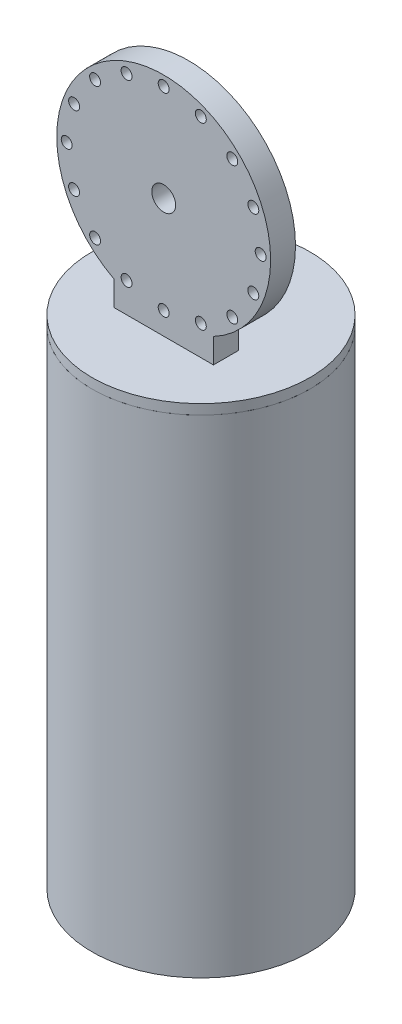
ISO-10303-21;
HEADER;
FILE_DESCRIPTION(('STEP AP214'),'2;1');
FILE_NAME('part.step','',(''),(''),'','','');
FILE_SCHEMA(('AUTOMOTIVE_DESIGN { 1 0 10303 214 1 1 1 1 }'));
ENDSEC;
DATA;
#1=APPLICATION_CONTEXT('core data for automotive mechanical design processes');
#2=APPLICATION_PROTOCOL_DEFINITION('international standard','automotive_design',2000,#1);
#3=PRODUCT_CONTEXT('',#1,'mechanical');
#4=PRODUCT('Part','Part','',(#3));
#5=PRODUCT_RELATED_PRODUCT_CATEGORY('part','',(#4));
#6=PRODUCT_DEFINITION_FORMATION('','',#4);
#7=PRODUCT_DEFINITION_CONTEXT('part definition',#1,'design');
#8=PRODUCT_DEFINITION('design','',#6,#7);
#9=PRODUCT_DEFINITION_SHAPE('','',#8);
#10=(LENGTH_UNIT() NAMED_UNIT(*) SI_UNIT(.MILLI.,.METRE.));
#11=(NAMED_UNIT(*) PLANE_ANGLE_UNIT() SI_UNIT($,.RADIAN.));
#12=(NAMED_UNIT(*) SI_UNIT($,.STERADIAN.) SOLID_ANGLE_UNIT());
#13=UNCERTAINTY_MEASURE_WITH_UNIT(LENGTH_MEASURE(1.E-05),#10,'distance_accuracy_value','');
#14=(GEOMETRIC_REPRESENTATION_CONTEXT(3) GLOBAL_UNCERTAINTY_ASSIGNED_CONTEXT((#13)) GLOBAL_UNIT_ASSIGNED_CONTEXT((#10,
#11,#12)) REPRESENTATION_CONTEXT('',''));
#15=CARTESIAN_POINT('',(0.,0.,0.));
#16=DIRECTION('',(0.,0.,1.));
#17=DIRECTION('',(1.,0.,0.));
#18=AXIS2_PLACEMENT_3D('',#15,#16,#17);
#19=CARTESIAN_POINT('',(0.,500.,0.));
#20=DIRECTION('',(0.,1.,0.));
#21=DIRECTION('',(0.,0.,1.));
#22=AXIS2_PLACEMENT_3D('',#19,#20,#21);
#23=PLANE('',#22);
#24=CARTESIAN_POINT('',(0.,500.,0.));
#25=DIRECTION('',(0.,1.,0.));
#26=DIRECTION('',(0.,0.,1.));
#27=AXIS2_PLACEMENT_3D('',#24,#25,#26);
#28=CIRCLE('',#27,109.54);
#29=CARTESIAN_POINT('',(0.,500.,109.54));
#30=VERTEX_POINT('',#29);
#31=EDGE_CURVE('E14',#30,#30,#28,.T.);
#32=ORIENTED_EDGE('',*,*,#31,.T.);
#33=EDGE_LOOP('',(#32));
#34=FACE_BOUND('',#33,.T.);
#35=DIRECTION('',(1.,0.,0.));
#36=VECTOR('',#35,1.);
#37=CARTESIAN_POINT('',(-50.,500.,12.5));
#38=LINE('',#37,#36);
#39=CARTESIAN_POINT('',(-50.,500.,12.5));
#40=VERTEX_POINT('',#39);
#41=CARTESIAN_POINT('',(50.,500.,12.5));
#42=VERTEX_POINT('',#41);
#43=EDGE_CURVE('E71',#40,#42,#38,.T.);
#44=ORIENTED_EDGE('',*,*,#43,.T.);
#45=DIRECTION('',(0.,0.,-1.));
#46=VECTOR('',#45,1.);
#47=CARTESIAN_POINT('',(50.,500.,37.5));
#48=LINE('',#47,#46);
#49=CARTESIAN_POINT('',(50.,500.,37.5));
#50=VERTEX_POINT('',#49);
#51=EDGE_CURVE('E117',#50,#42,#48,.T.);
#52=ORIENTED_EDGE('',*,*,#51,.F.);
#53=DIRECTION('',(1.,0.,0.));
#54=VECTOR('',#53,1.);
#55=CARTESIAN_POINT('',(-50.,500.,37.5));
#56=LINE('',#55,#54);
#57=CARTESIAN_POINT('',(-50.,500.,37.5));
#58=VERTEX_POINT('',#57);
#59=EDGE_CURVE('E111',#58,#50,#56,.T.);
#60=ORIENTED_EDGE('',*,*,#59,.F.);
#61=DIRECTION('',(0.,0.,-1.));
#62=VECTOR('',#61,1.);
#63=CARTESIAN_POINT('',(-50.,500.,37.5));
#64=LINE('',#63,#62);
#65=EDGE_CURVE('E122',#58,#40,#64,.T.);
#66=ORIENTED_EDGE('',*,*,#65,.T.);
#67=EDGE_LOOP('',(#44,#52,#60,#66));
#68=FACE_BOUND('',#67,.T.);
#69=ADVANCED_FACE('F56',(#34,#68),#23,.T.);
#70=CARTESIAN_POINT('',(0.,500.,0.));
#71=DIRECTION('',(0.,-1.,0.));
#72=DIRECTION('',(0.,0.,-1.));
#73=AXIS2_PLACEMENT_3D('',#70,#71,#72);
#74=CYLINDRICAL_SURFACE('',#73,109.54);
#75=ORIENTED_EDGE('',*,*,#31,.F.);
#76=EDGE_LOOP('',(#75));
#77=FACE_BOUND('',#76,.T.);
#78=CARTESIAN_POINT('',(0.,490.,0.));
#79=DIRECTION('',(0.,1.,0.));
#80=DIRECTION('',(0.,0.,1.));
#81=AXIS2_PLACEMENT_3D('',#78,#79,#80);
#82=CIRCLE('',#81,109.54);
#83=CARTESIAN_POINT('',(0.,490.,109.54));
#84=VERTEX_POINT('',#83);
#85=EDGE_CURVE('E60',#84,#84,#82,.T.);
#86=ORIENTED_EDGE('',*,*,#85,.T.);
#87=EDGE_LOOP('',(#86));
#88=FACE_BOUND('',#87,.T.);
#89=ADVANCED_FACE('F58',(#77,#88),#74,.T.);
#90=CARTESIAN_POINT('',(0.,490.,0.));
#91=DIRECTION('',(0.,1.,0.));
#92=DIRECTION('',(0.,0.,1.));
#93=AXIS2_PLACEMENT_3D('',#90,#91,#92);
#94=PLANE('',#93);
#95=ORIENTED_EDGE('',*,*,#85,.F.);
#96=EDGE_LOOP('',(#95));
#97=FACE_BOUND('',#96,.T.);
#98=ADVANCED_FACE('F139',(#97),#94,.F.);
#99=CARTESIAN_POINT('',(0.,620.,37.5));
#100=DIRECTION('',(0.,0.,1.));
#101=DIRECTION('',(1.,0.,0.));
#102=AXIS2_PLACEMENT_3D('',#99,#100,#101);
#103=PLANE('',#102);
#104=CARTESIAN_POINT('',(-68.9429111656866,688.942911165687,37.5));
#105=DIRECTION('',(0.,0.,1.));
#106=DIRECTION('',(1.,0.,0.));
#107=AXIS2_PLACEMENT_3D('',#104,#105,#106);
#108=CIRCLE('',#107,5.49999999999993);
#109=CARTESIAN_POINT('',(-63.4429111656867,688.942911165687,37.5));
#110=VERTEX_POINT('',#109);
#111=EDGE_CURVE('E248',#110,#110,#108,.T.);
#112=ORIENTED_EDGE('',*,*,#111,.F.);
#113=EDGE_LOOP('',(#112));
#114=FACE_BOUND('',#113,.T.);
#115=CARTESIAN_POINT('',(-97.5,620.,37.5));
#116=DIRECTION('',(0.,0.,1.));
#117=DIRECTION('',(1.,0.,0.));
#118=AXIS2_PLACEMENT_3D('',#115,#116,#117);
#119=CIRCLE('',#118,5.49999999999767);
#120=CARTESIAN_POINT('',(-92.0000000000023,620.,37.5));
#121=VERTEX_POINT('',#120);
#122=EDGE_CURVE('E260',#121,#121,#119,.T.);
#123=ORIENTED_EDGE('',*,*,#122,.F.);
#124=EDGE_LOOP('',(#123));
#125=FACE_BOUND('',#124,.T.);
#126=CARTESIAN_POINT('',(-68.9429111656843,551.05708883431,37.5));
#127=DIRECTION('',(0.,0.,1.));
#128=DIRECTION('',(1.,0.,0.));
#129=AXIS2_PLACEMENT_3D('',#126,#127,#128);
#130=CIRCLE('',#129,5.49999999999993);
#131=CARTESIAN_POINT('',(-63.4429111656844,551.05708883431,37.5));
#132=VERTEX_POINT('',#131);
#133=EDGE_CURVE('E272',#132,#132,#130,.T.);
#134=ORIENTED_EDGE('',*,*,#133,.F.);
#135=EDGE_LOOP('',(#134));
#136=FACE_BOUND('',#135,.T.);
#137=CARTESIAN_POINT('',(4.82557355897931E-12,522.5,37.5));
#138=DIRECTION('',(0.,0.,1.));
#139=DIRECTION('',(1.,0.,0.));
#140=AXIS2_PLACEMENT_3D('',#137,#138,#139);
#141=CIRCLE('',#140,5.50000000000001);
#142=CARTESIAN_POINT('',(5.50000000000484,522.5,37.5));
#143=VERTEX_POINT('',#142);
#144=EDGE_CURVE('E284',#143,#143,#141,.T.);
#145=ORIENTED_EDGE('',*,*,#144,.F.);
#146=EDGE_LOOP('',(#145));
#147=FACE_BOUND('',#146,.T.);
#148=CARTESIAN_POINT('',(68.9429111656928,551.057088834313,37.5));
#149=DIRECTION('',(0.,0.,1.));
#150=DIRECTION('',(1.,0.,0.));
#151=AXIS2_PLACEMENT_3D('',#148,#149,#150);
#152=CIRCLE('',#151,5.50000000000008);
#153=CARTESIAN_POINT('',(74.4429111656929,551.057088834313,37.5));
#154=VERTEX_POINT('',#153);
#155=EDGE_CURVE('E296',#154,#154,#152,.T.);
#156=ORIENTED_EDGE('',*,*,#155,.F.);
#157=EDGE_LOOP('',(#156));
#158=FACE_BOUND('',#157,.T.);
#159=CARTESIAN_POINT('',(97.5000000000028,620.000000000002,37.5));
#160=DIRECTION('',(0.,0.,1.));
#161=DIRECTION('',(1.,0.,0.));
#162=AXIS2_PLACEMENT_3D('',#159,#160,#161);
#163=CIRCLE('',#162,5.49999999999996);
#164=CARTESIAN_POINT('',(103.000000000003,620.000000000002,37.5));
#165=VERTEX_POINT('',#164);
#166=EDGE_CURVE('E308',#165,#165,#163,.T.);
#167=ORIENTED_EDGE('',*,*,#166,.F.);
#168=EDGE_LOOP('',(#167));
#169=FACE_BOUND('',#168,.T.);
#170=CARTESIAN_POINT('',(68.9429111656894,688.94291116569,37.5));
#171=DIRECTION('',(0.,0.,1.));
#172=DIRECTION('',(1.,0.,0.));
#173=AXIS2_PLACEMENT_3D('',#170,#171,#172);
#174=CIRCLE('',#173,5.50000000000002);
#175=CARTESIAN_POINT('',(74.4429111656894,688.94291116569,37.5));
#176=VERTEX_POINT('',#175);
#177=EDGE_CURVE('E320',#176,#176,#174,.T.);
#178=ORIENTED_EDGE('',*,*,#177,.F.);
#179=EDGE_LOOP('',(#178));
#180=FACE_BOUND('',#179,.T.);
#181=CARTESIAN_POINT('',(0.,717.5,37.5));
#182=DIRECTION('',(0.,0.,1.));
#183=DIRECTION('',(1.,0.,0.));
#184=AXIS2_PLACEMENT_3D('',#181,#182,#183);
#185=CIRCLE('',#184,5.5);
#186=CARTESIAN_POINT('',(5.5,717.5,37.5));
#187=VERTEX_POINT('',#186);
#188=EDGE_CURVE('E332',#187,#187,#185,.T.);
#189=ORIENTED_EDGE('',*,*,#188,.F.);
#190=EDGE_LOOP('',(#189));
#191=FACE_BOUND('',#190,.T.);
#192=ORIENTED_EDGE('',*,*,#59,.T.);
#193=DIRECTION('',(0.,1.,0.));
#194=VECTOR('',#193,1.);
#195=CARTESIAN_POINT('',(50.,500.,37.5));
#196=LINE('',#195,#194);
#197=CARTESIAN_POINT('',(50.,524.835668446629,37.5));
#198=VERTEX_POINT('',#197);
#199=EDGE_CURVE('E105',#50,#198,#196,.T.);
#200=ORIENTED_EDGE('',*,*,#199,.T.);
#201=CARTESIAN_POINT('',(0.,620.,37.5));
#202=DIRECTION('',(0.,0.,1.));
#203=DIRECTION('',(1.,0.,0.));
#204=AXIS2_PLACEMENT_3D('',#201,#202,#203);
#205=CIRCLE('',#204,107.5);
#206=CARTESIAN_POINT('',(-50.,524.835668446629,37.5));
#207=VERTEX_POINT('',#206);
#208=EDGE_CURVE('E109',#198,#207,#205,.T.);
#209=ORIENTED_EDGE('',*,*,#208,.T.);
#210=DIRECTION('',(0.,-1.,0.));
#211=VECTOR('',#210,1.);
#212=CARTESIAN_POINT('',(-50.,500.,37.5));
#213=LINE('',#212,#211);
#214=EDGE_CURVE('E80',#207,#58,#213,.T.);
#215=ORIENTED_EDGE('',*,*,#214,.T.);
#216=EDGE_LOOP('',(#192,#200,#209,#215));
#217=FACE_BOUND('',#216,.T.);
#218=CARTESIAN_POINT('',(0.,620.,37.5));
#219=DIRECTION('',(0.,0.,1.));
#220=DIRECTION('',(1.,0.,0.));
#221=AXIS2_PLACEMENT_3D('',#218,#219,#220);
#222=CIRCLE('',#221,12.);
#223=CARTESIAN_POINT('',(12.,620.,37.5));
#224=VERTEX_POINT('',#223);
#225=EDGE_CURVE('E127',#224,#224,#222,.T.);
#226=ORIENTED_EDGE('',*,*,#225,.F.);
#227=EDGE_LOOP('',(#226));
#228=FACE_BOUND('',#227,.T.);
#229=CARTESIAN_POINT('',(37.3116346555965,710.078254419851,37.5));
#230=DIRECTION('',(0.,0.,1.));
#231=DIRECTION('',(1.,0.,0.));
#232=AXIS2_PLACEMENT_3D('',#229,#230,#231);
#233=CIRCLE('',#232,5.50000000000002);
#234=CARTESIAN_POINT('',(42.8116346555965,710.078254419851,37.5));
#235=VERTEX_POINT('',#234);
#236=EDGE_CURVE('E326',#235,#235,#233,.T.);
#237=ORIENTED_EDGE('',*,*,#236,.F.);
#238=EDGE_LOOP('',(#237));
#239=FACE_BOUND('',#238,.T.);
#240=CARTESIAN_POINT('',(90.0782544198523,657.311634655598,37.5));
#241=DIRECTION('',(0.,0.,1.));
#242=DIRECTION('',(1.,0.,0.));
#243=AXIS2_PLACEMENT_3D('',#240,#241,#242);
#244=CIRCLE('',#243,5.50000000000008);
#245=CARTESIAN_POINT('',(95.5782544198524,657.311634655598,37.5));
#246=VERTEX_POINT('',#245);
#247=EDGE_CURVE('E314',#246,#246,#244,.T.);
#248=ORIENTED_EDGE('',*,*,#247,.F.);
#249=EDGE_LOOP('',(#248));
#250=FACE_BOUND('',#249,.T.);
#251=CARTESIAN_POINT('',(90.0782544198543,582.688365344406,37.5));
#252=DIRECTION('',(0.,0.,1.));
#253=DIRECTION('',(1.,0.,0.));
#254=AXIS2_PLACEMENT_3D('',#251,#252,#253);
#255=CIRCLE('',#254,5.49999999999992);
#256=CARTESIAN_POINT('',(95.5782544198542,582.688365344406,37.5));
#257=VERTEX_POINT('',#256);
#258=EDGE_CURVE('E302',#257,#257,#255,.T.);
#259=ORIENTED_EDGE('',*,*,#258,.F.);
#260=EDGE_LOOP('',(#259));
#261=FACE_BOUND('',#260,.T.);
#262=CARTESIAN_POINT('',(37.311634655601,529.92174558015,37.5));
#263=DIRECTION('',(0.,0.,1.));
#264=DIRECTION('',(1.,0.,0.));
#265=AXIS2_PLACEMENT_3D('',#262,#263,#264);
#266=CIRCLE('',#265,5.50000000000004);
#267=CARTESIAN_POINT('',(42.8116346556011,529.92174558015,37.5));
#268=VERTEX_POINT('',#267);
#269=EDGE_CURVE('E290',#268,#268,#266,.T.);
#270=ORIENTED_EDGE('',*,*,#269,.F.);
#271=EDGE_LOOP('',(#270));
#272=FACE_BOUND('',#271,.T.);
#273=CARTESIAN_POINT('',(-37.3116346555917,529.921745580148,37.5));
#274=DIRECTION('',(0.,0.,1.));
#275=DIRECTION('',(1.,0.,0.));
#276=AXIS2_PLACEMENT_3D('',#273,#274,#275);
#277=CIRCLE('',#276,5.50000000000003);
#278=CARTESIAN_POINT('',(-31.8116346555916,529.921745580148,37.5));
#279=VERTEX_POINT('',#278);
#280=EDGE_CURVE('E278',#279,#279,#277,.T.);
#281=ORIENTED_EDGE('',*,*,#280,.F.);
#282=EDGE_LOOP('',(#281));
#283=FACE_BOUND('',#282,.T.);
#284=CARTESIAN_POINT('',(-90.0782544198471,582.688365344402,37.5));
#285=DIRECTION('',(0.,0.,1.));
#286=DIRECTION('',(1.,0.,0.));
#287=AXIS2_PLACEMENT_3D('',#284,#285,#286);
#288=CIRCLE('',#287,5.49999999999999);
#289=CARTESIAN_POINT('',(-84.5782544198471,582.688365344402,37.5));
#290=VERTEX_POINT('',#289);
#291=EDGE_CURVE('E266',#290,#290,#288,.T.);
#292=ORIENTED_EDGE('',*,*,#291,.F.);
#293=EDGE_LOOP('',(#292));
#294=FACE_BOUND('',#293,.T.);
#295=CARTESIAN_POINT('',(-90.0782544198482,657.311634655595,37.5));
#296=DIRECTION('',(0.,0.,1.));
#297=DIRECTION('',(1.,0.,0.));
#298=AXIS2_PLACEMENT_3D('',#295,#296,#297);
#299=CIRCLE('',#298,5.50000000000003);
#300=CARTESIAN_POINT('',(-84.5782544198482,657.311634655595,37.5));
#301=VERTEX_POINT('',#300);
#302=EDGE_CURVE('E254',#301,#301,#299,.T.);
#303=ORIENTED_EDGE('',*,*,#302,.F.);
#304=EDGE_LOOP('',(#303));
#305=FACE_BOUND('',#304,.T.);
#306=CARTESIAN_POINT('',(-37.3116346555949,710.07825441985,37.5));
#307=DIRECTION('',(0.,0.,1.));
#308=DIRECTION('',(1.,0.,0.));
#309=AXIS2_PLACEMENT_3D('',#306,#307,#308);
#310=CIRCLE('',#309,5.49999999999994);
#311=CARTESIAN_POINT('',(-31.811634655595,710.07825441985,37.5));
#312=VERTEX_POINT('',#311);
#313=EDGE_CURVE('E239',#312,#312,#310,.T.);
#314=ORIENTED_EDGE('',*,*,#313,.F.);
#315=EDGE_LOOP('',(#314));
#316=FACE_BOUND('',#315,.T.);
#317=ADVANCED_FACE('F106',(#114,#125,#136,#147,#158,#169,#180,#191,#217,#228,#239,#250,#261,
#272,#283,#294,#305,#316),#103,.T.);
#318=CARTESIAN_POINT('',(0.,620.,12.5));
#319=DIRECTION('',(0.,0.,1.));
#320=DIRECTION('',(1.,0.,0.));
#321=AXIS2_PLACEMENT_3D('',#318,#319,#320);
#322=PLANE('',#321);
#323=CARTESIAN_POINT('',(-68.9429111656866,688.942911165687,12.5));
#324=DIRECTION('',(0.,0.,1.));
#325=DIRECTION('',(1.,0.,0.));
#326=AXIS2_PLACEMENT_3D('',#323,#324,#325);
#327=CIRCLE('',#326,5.49999999999993);
#328=CARTESIAN_POINT('',(-63.4429111656867,688.942911165687,12.5));
#329=VERTEX_POINT('',#328);
#330=EDGE_CURVE('E245',#329,#329,#327,.T.);
#331=ORIENTED_EDGE('',*,*,#330,.T.);
#332=EDGE_LOOP('',(#331));
#333=FACE_BOUND('',#332,.T.);
#334=CARTESIAN_POINT('',(-97.5,620.,12.5));
#335=DIRECTION('',(0.,0.,1.));
#336=DIRECTION('',(1.,0.,0.));
#337=AXIS2_PLACEMENT_3D('',#334,#335,#336);
#338=CIRCLE('',#337,5.49999999999767);
#339=CARTESIAN_POINT('',(-92.0000000000023,620.,12.5));
#340=VERTEX_POINT('',#339);
#341=EDGE_CURVE('E257',#340,#340,#338,.T.);
#342=ORIENTED_EDGE('',*,*,#341,.T.);
#343=EDGE_LOOP('',(#342));
#344=FACE_BOUND('',#343,.T.);
#345=CARTESIAN_POINT('',(-68.9429111656843,551.05708883431,12.5));
#346=DIRECTION('',(0.,0.,1.));
#347=DIRECTION('',(1.,0.,0.));
#348=AXIS2_PLACEMENT_3D('',#345,#346,#347);
#349=CIRCLE('',#348,5.49999999999993);
#350=CARTESIAN_POINT('',(-63.4429111656844,551.05708883431,12.5));
#351=VERTEX_POINT('',#350);
#352=EDGE_CURVE('E269',#351,#351,#349,.T.);
#353=ORIENTED_EDGE('',*,*,#352,.T.);
#354=EDGE_LOOP('',(#353));
#355=FACE_BOUND('',#354,.T.);
#356=CARTESIAN_POINT('',(4.82557355897931E-12,522.5,12.5));
#357=DIRECTION('',(0.,0.,1.));
#358=DIRECTION('',(1.,0.,0.));
#359=AXIS2_PLACEMENT_3D('',#356,#357,#358);
#360=CIRCLE('',#359,5.50000000000001);
#361=CARTESIAN_POINT('',(5.50000000000484,522.5,12.5));
#362=VERTEX_POINT('',#361);
#363=EDGE_CURVE('E281',#362,#362,#360,.T.);
#364=ORIENTED_EDGE('',*,*,#363,.T.);
#365=EDGE_LOOP('',(#364));
#366=FACE_BOUND('',#365,.T.);
#367=CARTESIAN_POINT('',(68.9429111656928,551.057088834313,12.5));
#368=DIRECTION('',(0.,0.,1.));
#369=DIRECTION('',(1.,0.,0.));
#370=AXIS2_PLACEMENT_3D('',#367,#368,#369);
#371=CIRCLE('',#370,5.50000000000008);
#372=CARTESIAN_POINT('',(74.4429111656929,551.057088834313,12.5));
#373=VERTEX_POINT('',#372);
#374=EDGE_CURVE('E293',#373,#373,#371,.T.);
#375=ORIENTED_EDGE('',*,*,#374,.T.);
#376=EDGE_LOOP('',(#375));
#377=FACE_BOUND('',#376,.T.);
#378=CARTESIAN_POINT('',(97.5000000000028,620.000000000002,12.5));
#379=DIRECTION('',(0.,0.,1.));
#380=DIRECTION('',(1.,0.,0.));
#381=AXIS2_PLACEMENT_3D('',#378,#379,#380);
#382=CIRCLE('',#381,5.49999999999996);
#383=CARTESIAN_POINT('',(103.000000000003,620.000000000002,12.5));
#384=VERTEX_POINT('',#383);
#385=EDGE_CURVE('E305',#384,#384,#382,.T.);
#386=ORIENTED_EDGE('',*,*,#385,.T.);
#387=EDGE_LOOP('',(#386));
#388=FACE_BOUND('',#387,.T.);
#389=CARTESIAN_POINT('',(68.9429111656894,688.94291116569,12.5));
#390=DIRECTION('',(0.,0.,1.));
#391=DIRECTION('',(1.,0.,0.));
#392=AXIS2_PLACEMENT_3D('',#389,#390,#391);
#393=CIRCLE('',#392,5.50000000000002);
#394=CARTESIAN_POINT('',(74.4429111656894,688.94291116569,12.5));
#395=VERTEX_POINT('',#394);
#396=EDGE_CURVE('E317',#395,#395,#393,.T.);
#397=ORIENTED_EDGE('',*,*,#396,.T.);
#398=EDGE_LOOP('',(#397));
#399=FACE_BOUND('',#398,.T.);
#400=CARTESIAN_POINT('',(0.,717.5,12.5));
#401=DIRECTION('',(0.,0.,1.));
#402=DIRECTION('',(1.,0.,0.));
#403=AXIS2_PLACEMENT_3D('',#400,#401,#402);
#404=CIRCLE('',#403,5.5);
#405=CARTESIAN_POINT('',(5.5,717.5,12.5));
#406=VERTEX_POINT('',#405);
#407=EDGE_CURVE('E329',#406,#406,#404,.T.);
#408=ORIENTED_EDGE('',*,*,#407,.T.);
#409=EDGE_LOOP('',(#408));
#410=FACE_BOUND('',#409,.T.);
#411=ORIENTED_EDGE('',*,*,#43,.F.);
#412=DIRECTION('',(0.,-1.,0.));
#413=VECTOR('',#412,1.);
#414=CARTESIAN_POINT('',(-50.,500.,12.5));
#415=LINE('',#414,#413);
#416=CARTESIAN_POINT('',(-50.,524.835668446629,12.5));
#417=VERTEX_POINT('',#416);
#418=EDGE_CURVE('E130',#417,#40,#415,.T.);
#419=ORIENTED_EDGE('',*,*,#418,.F.);
#420=CARTESIAN_POINT('',(0.,620.,12.5));
#421=DIRECTION('',(0.,0.,1.));
#422=DIRECTION('',(1.,0.,0.));
#423=AXIS2_PLACEMENT_3D('',#420,#421,#422);
#424=CIRCLE('',#423,107.5);
#425=CARTESIAN_POINT('',(50.,524.835668446629,12.5));
#426=VERTEX_POINT('',#425);
#427=EDGE_CURVE('E97',#426,#417,#424,.T.);
#428=ORIENTED_EDGE('',*,*,#427,.F.);
#429=DIRECTION('',(0.,1.,0.));
#430=VECTOR('',#429,1.);
#431=CARTESIAN_POINT('',(50.,500.,12.5));
#432=LINE('',#431,#430);
#433=EDGE_CURVE('E116',#42,#426,#432,.T.);
#434=ORIENTED_EDGE('',*,*,#433,.F.);
#435=EDGE_LOOP('',(#411,#419,#428,#434));
#436=FACE_BOUND('',#435,.T.);
#437=CARTESIAN_POINT('',(0.,620.,12.5));
#438=DIRECTION('',(0.,0.,1.));
#439=DIRECTION('',(1.,0.,0.));
#440=AXIS2_PLACEMENT_3D('',#437,#438,#439);
#441=CIRCLE('',#440,12.);
#442=CARTESIAN_POINT('',(12.,620.,12.5));
#443=VERTEX_POINT('',#442);
#444=EDGE_CURVE('E335',#443,#443,#441,.T.);
#445=ORIENTED_EDGE('',*,*,#444,.T.);
#446=EDGE_LOOP('',(#445));
#447=FACE_BOUND('',#446,.T.);
#448=CARTESIAN_POINT('',(37.3116346555965,710.078254419851,12.5));
#449=DIRECTION('',(0.,0.,1.));
#450=DIRECTION('',(1.,0.,0.));
#451=AXIS2_PLACEMENT_3D('',#448,#449,#450);
#452=CIRCLE('',#451,5.50000000000002);
#453=CARTESIAN_POINT('',(42.8116346555965,710.078254419851,12.5));
#454=VERTEX_POINT('',#453);
#455=EDGE_CURVE('E323',#454,#454,#452,.T.);
#456=ORIENTED_EDGE('',*,*,#455,.T.);
#457=EDGE_LOOP('',(#456));
#458=FACE_BOUND('',#457,.T.);
#459=CARTESIAN_POINT('',(90.0782544198523,657.311634655598,12.5));
#460=DIRECTION('',(0.,0.,1.));
#461=DIRECTION('',(1.,0.,0.));
#462=AXIS2_PLACEMENT_3D('',#459,#460,#461);
#463=CIRCLE('',#462,5.50000000000008);
#464=CARTESIAN_POINT('',(95.5782544198524,657.311634655598,12.5));
#465=VERTEX_POINT('',#464);
#466=EDGE_CURVE('E311',#465,#465,#463,.T.);
#467=ORIENTED_EDGE('',*,*,#466,.T.);
#468=EDGE_LOOP('',(#467));
#469=FACE_BOUND('',#468,.T.);
#470=CARTESIAN_POINT('',(90.0782544198543,582.688365344406,12.5));
#471=DIRECTION('',(0.,0.,1.));
#472=DIRECTION('',(1.,0.,0.));
#473=AXIS2_PLACEMENT_3D('',#470,#471,#472);
#474=CIRCLE('',#473,5.49999999999992);
#475=CARTESIAN_POINT('',(95.5782544198542,582.688365344406,12.5));
#476=VERTEX_POINT('',#475);
#477=EDGE_CURVE('E299',#476,#476,#474,.T.);
#478=ORIENTED_EDGE('',*,*,#477,.T.);
#479=EDGE_LOOP('',(#478));
#480=FACE_BOUND('',#479,.T.);
#481=CARTESIAN_POINT('',(37.311634655601,529.92174558015,12.5));
#482=DIRECTION('',(0.,0.,1.));
#483=DIRECTION('',(1.,0.,0.));
#484=AXIS2_PLACEMENT_3D('',#481,#482,#483);
#485=CIRCLE('',#484,5.50000000000004);
#486=CARTESIAN_POINT('',(42.8116346556011,529.92174558015,12.5));
#487=VERTEX_POINT('',#486);
#488=EDGE_CURVE('E287',#487,#487,#485,.T.);
#489=ORIENTED_EDGE('',*,*,#488,.T.);
#490=EDGE_LOOP('',(#489));
#491=FACE_BOUND('',#490,.T.);
#492=CARTESIAN_POINT('',(-37.3116346555917,529.921745580148,12.5));
#493=DIRECTION('',(0.,0.,1.));
#494=DIRECTION('',(1.,0.,0.));
#495=AXIS2_PLACEMENT_3D('',#492,#493,#494);
#496=CIRCLE('',#495,5.50000000000003);
#497=CARTESIAN_POINT('',(-31.8116346555916,529.921745580148,12.5));
#498=VERTEX_POINT('',#497);
#499=EDGE_CURVE('E275',#498,#498,#496,.T.);
#500=ORIENTED_EDGE('',*,*,#499,.T.);
#501=EDGE_LOOP('',(#500));
#502=FACE_BOUND('',#501,.T.);
#503=CARTESIAN_POINT('',(-90.0782544198471,582.688365344402,12.5));
#504=DIRECTION('',(0.,0.,1.));
#505=DIRECTION('',(1.,0.,0.));
#506=AXIS2_PLACEMENT_3D('',#503,#504,#505);
#507=CIRCLE('',#506,5.49999999999999);
#508=CARTESIAN_POINT('',(-84.5782544198471,582.688365344402,12.5));
#509=VERTEX_POINT('',#508);
#510=EDGE_CURVE('E263',#509,#509,#507,.T.);
#511=ORIENTED_EDGE('',*,*,#510,.T.);
#512=EDGE_LOOP('',(#511));
#513=FACE_BOUND('',#512,.T.);
#514=CARTESIAN_POINT('',(-90.0782544198482,657.311634655595,12.5));
#515=DIRECTION('',(0.,0.,1.));
#516=DIRECTION('',(1.,0.,0.));
#517=AXIS2_PLACEMENT_3D('',#514,#515,#516);
#518=CIRCLE('',#517,5.50000000000003);
#519=CARTESIAN_POINT('',(-84.5782544198482,657.311634655595,12.5));
#520=VERTEX_POINT('',#519);
#521=EDGE_CURVE('E251',#520,#520,#518,.T.);
#522=ORIENTED_EDGE('',*,*,#521,.T.);
#523=EDGE_LOOP('',(#522));
#524=FACE_BOUND('',#523,.T.);
#525=CARTESIAN_POINT('',(-37.3116346555949,710.07825441985,12.5));
#526=DIRECTION('',(0.,0.,1.));
#527=DIRECTION('',(1.,0.,0.));
#528=AXIS2_PLACEMENT_3D('',#525,#526,#527);
#529=CIRCLE('',#528,5.49999999999994);
#530=CARTESIAN_POINT('',(-31.811634655595,710.07825441985,12.5));
#531=VERTEX_POINT('',#530);
#532=EDGE_CURVE('E242',#531,#531,#529,.T.);
#533=ORIENTED_EDGE('',*,*,#532,.T.);
#534=EDGE_LOOP('',(#533));
#535=FACE_BOUND('',#534,.T.);
#536=ADVANCED_FACE('F145',(#333,#344,#355,#366,#377,#388,#399,#410,#436,#447,#458,#469,#480,
#491,#502,#513,#524,#535),#322,.F.);
#537=CARTESIAN_POINT('',(50.,500.,37.5));
#538=DIRECTION('',(-1.,0.,0.));
#539=DIRECTION('',(0.,-1.,0.));
#540=AXIS2_PLACEMENT_3D('',#537,#538,#539);
#541=PLANE('',#540);
#542=ORIENTED_EDGE('',*,*,#433,.T.);
#543=DIRECTION('',(0.,0.,-1.));
#544=VECTOR('',#543,1.);
#545=CARTESIAN_POINT('',(50.,524.835668446629,37.5));
#546=LINE('',#545,#544);
#547=EDGE_CURVE('E114',#198,#426,#546,.T.);
#548=ORIENTED_EDGE('',*,*,#547,.F.);
#549=ORIENTED_EDGE('',*,*,#199,.F.);
#550=ORIENTED_EDGE('',*,*,#51,.T.);
#551=EDGE_LOOP('',(#542,#548,#549,#550));
#552=FACE_BOUND('',#551,.T.);
#553=ADVANCED_FACE('F115',(#552),#541,.F.);
#554=CARTESIAN_POINT('',(0.,620.,37.5));
#555=DIRECTION('',(0.,0.,-1.));
#556=DIRECTION('',(-1.,0.,0.));
#557=AXIS2_PLACEMENT_3D('',#554,#555,#556);
#558=CYLINDRICAL_SURFACE('',#557,107.5);
#559=ORIENTED_EDGE('',*,*,#427,.T.);
#560=DIRECTION('',(0.,0.,-1.));
#561=VECTOR('',#560,1.);
#562=CARTESIAN_POINT('',(-50.,524.835668446629,37.5));
#563=LINE('',#562,#561);
#564=EDGE_CURVE('E118',#207,#417,#563,.T.);
#565=ORIENTED_EDGE('',*,*,#564,.F.);
#566=ORIENTED_EDGE('',*,*,#208,.F.);
#567=ORIENTED_EDGE('',*,*,#547,.T.);
#568=EDGE_LOOP('',(#559,#565,#566,#567));
#569=FACE_BOUND('',#568,.T.);
#570=ADVANCED_FACE('F120',(#569),#558,.T.);
#571=CARTESIAN_POINT('',(-50.,500.,37.5));
#572=DIRECTION('',(1.,0.,0.));
#573=DIRECTION('',(0.,1.,0.));
#574=AXIS2_PLACEMENT_3D('',#571,#572,#573);
#575=PLANE('',#574);
#576=ORIENTED_EDGE('',*,*,#418,.T.);
#577=ORIENTED_EDGE('',*,*,#65,.F.);
#578=ORIENTED_EDGE('',*,*,#214,.F.);
#579=ORIENTED_EDGE('',*,*,#564,.T.);
#580=EDGE_LOOP('',(#576,#577,#578,#579));
#581=FACE_BOUND('',#580,.T.);
#582=ADVANCED_FACE('F160',(#581),#575,.F.);
#583=CARTESIAN_POINT('',(0.,620.,37.5));
#584=DIRECTION('',(0.,0.,-1.));
#585=DIRECTION('',(-1.,0.,0.));
#586=AXIS2_PLACEMENT_3D('',#583,#584,#585);
#587=CYLINDRICAL_SURFACE('',#586,12.);
#588=ORIENTED_EDGE('',*,*,#225,.T.);
#589=EDGE_LOOP('',(#588));
#590=FACE_BOUND('',#589,.T.);
#591=ORIENTED_EDGE('',*,*,#444,.F.);
#592=EDGE_LOOP('',(#591));
#593=FACE_BOUND('',#592,.T.);
#594=ADVANCED_FACE('F163',(#590,#593),#587,.F.);
#595=CARTESIAN_POINT('',(0.,717.5,37.5));
#596=DIRECTION('',(0.,0.,-1.));
#597=DIRECTION('',(-1.,0.,0.));
#598=AXIS2_PLACEMENT_3D('',#595,#596,#597);
#599=CYLINDRICAL_SURFACE('',#598,5.5);
#600=ORIENTED_EDGE('',*,*,#188,.T.);
#601=EDGE_LOOP('',(#600));
#602=FACE_BOUND('',#601,.T.);
#603=ORIENTED_EDGE('',*,*,#407,.F.);
#604=EDGE_LOOP('',(#603));
#605=FACE_BOUND('',#604,.T.);
#606=ADVANCED_FACE('F170',(#602,#605),#599,.F.);
#607=CARTESIAN_POINT('',(37.3116346555965,710.078254419851,37.5));
#608=DIRECTION('',(0.,0.,-1.));
#609=DIRECTION('',(-1.,0.,0.));
#610=AXIS2_PLACEMENT_3D('',#607,#608,#609);
#611=CYLINDRICAL_SURFACE('',#610,5.50000000000002);
#612=ORIENTED_EDGE('',*,*,#236,.T.);
#613=EDGE_LOOP('',(#612));
#614=FACE_BOUND('',#613,.T.);
#615=ORIENTED_EDGE('',*,*,#455,.F.);
#616=EDGE_LOOP('',(#615));
#617=FACE_BOUND('',#616,.T.);
#618=ADVANCED_FACE('F174',(#614,#617),#611,.F.);
#619=CARTESIAN_POINT('',(68.9429111656894,688.94291116569,37.5));
#620=DIRECTION('',(0.,0.,-1.));
#621=DIRECTION('',(-1.,0.,0.));
#622=AXIS2_PLACEMENT_3D('',#619,#620,#621);
#623=CYLINDRICAL_SURFACE('',#622,5.50000000000002);
#624=ORIENTED_EDGE('',*,*,#177,.T.);
#625=EDGE_LOOP('',(#624));
#626=FACE_BOUND('',#625,.T.);
#627=ORIENTED_EDGE('',*,*,#396,.F.);
#628=EDGE_LOOP('',(#627));
#629=FACE_BOUND('',#628,.T.);
#630=ADVANCED_FACE('F178',(#626,#629),#623,.F.);
#631=CARTESIAN_POINT('',(90.0782544198523,657.311634655598,37.5));
#632=DIRECTION('',(0.,0.,-1.));
#633=DIRECTION('',(-1.,0.,0.));
#634=AXIS2_PLACEMENT_3D('',#631,#632,#633);
#635=CYLINDRICAL_SURFACE('',#634,5.50000000000008);
#636=ORIENTED_EDGE('',*,*,#247,.T.);
#637=EDGE_LOOP('',(#636));
#638=FACE_BOUND('',#637,.T.);
#639=ORIENTED_EDGE('',*,*,#466,.F.);
#640=EDGE_LOOP('',(#639));
#641=FACE_BOUND('',#640,.T.);
#642=ADVANCED_FACE('F182',(#638,#641),#635,.F.);
#643=CARTESIAN_POINT('',(97.5000000000028,620.000000000002,37.5));
#644=DIRECTION('',(0.,0.,-1.));
#645=DIRECTION('',(-1.,0.,0.));
#646=AXIS2_PLACEMENT_3D('',#643,#644,#645);
#647=CYLINDRICAL_SURFACE('',#646,5.49999999999996);
#648=ORIENTED_EDGE('',*,*,#166,.T.);
#649=EDGE_LOOP('',(#648));
#650=FACE_BOUND('',#649,.T.);
#651=ORIENTED_EDGE('',*,*,#385,.F.);
#652=EDGE_LOOP('',(#651));
#653=FACE_BOUND('',#652,.T.);
#654=ADVANCED_FACE('F186',(#650,#653),#647,.F.);
#655=CARTESIAN_POINT('',(90.0782544198543,582.688365344406,37.5));
#656=DIRECTION('',(0.,0.,-1.));
#657=DIRECTION('',(-1.,0.,0.));
#658=AXIS2_PLACEMENT_3D('',#655,#656,#657);
#659=CYLINDRICAL_SURFACE('',#658,5.49999999999992);
#660=ORIENTED_EDGE('',*,*,#258,.T.);
#661=EDGE_LOOP('',(#660));
#662=FACE_BOUND('',#661,.T.);
#663=ORIENTED_EDGE('',*,*,#477,.F.);
#664=EDGE_LOOP('',(#663));
#665=FACE_BOUND('',#664,.T.);
#666=ADVANCED_FACE('F190',(#662,#665),#659,.F.);
#667=CARTESIAN_POINT('',(68.9429111656928,551.057088834313,37.5));
#668=DIRECTION('',(0.,0.,-1.));
#669=DIRECTION('',(-1.,0.,0.));
#670=AXIS2_PLACEMENT_3D('',#667,#668,#669);
#671=CYLINDRICAL_SURFACE('',#670,5.50000000000008);
#672=ORIENTED_EDGE('',*,*,#155,.T.);
#673=EDGE_LOOP('',(#672));
#674=FACE_BOUND('',#673,.T.);
#675=ORIENTED_EDGE('',*,*,#374,.F.);
#676=EDGE_LOOP('',(#675));
#677=FACE_BOUND('',#676,.T.);
#678=ADVANCED_FACE('F194',(#674,#677),#671,.F.);
#679=CARTESIAN_POINT('',(37.311634655601,529.92174558015,37.5));
#680=DIRECTION('',(0.,0.,-1.));
#681=DIRECTION('',(-1.,0.,0.));
#682=AXIS2_PLACEMENT_3D('',#679,#680,#681);
#683=CYLINDRICAL_SURFACE('',#682,5.50000000000004);
#684=ORIENTED_EDGE('',*,*,#269,.T.);
#685=EDGE_LOOP('',(#684));
#686=FACE_BOUND('',#685,.T.);
#687=ORIENTED_EDGE('',*,*,#488,.F.);
#688=EDGE_LOOP('',(#687));
#689=FACE_BOUND('',#688,.T.);
#690=ADVANCED_FACE('F198',(#686,#689),#683,.F.);
#691=CARTESIAN_POINT('',(4.82557355897931E-12,522.5,37.5));
#692=DIRECTION('',(0.,0.,-1.));
#693=DIRECTION('',(-1.,0.,0.));
#694=AXIS2_PLACEMENT_3D('',#691,#692,#693);
#695=CYLINDRICAL_SURFACE('',#694,5.50000000000001);
#696=ORIENTED_EDGE('',*,*,#144,.T.);
#697=EDGE_LOOP('',(#696));
#698=FACE_BOUND('',#697,.T.);
#699=ORIENTED_EDGE('',*,*,#363,.F.);
#700=EDGE_LOOP('',(#699));
#701=FACE_BOUND('',#700,.T.);
#702=ADVANCED_FACE('F202',(#698,#701),#695,.F.);
#703=CARTESIAN_POINT('',(-37.3116346555917,529.921745580148,37.5));
#704=DIRECTION('',(0.,0.,-1.));
#705=DIRECTION('',(-1.,0.,0.));
#706=AXIS2_PLACEMENT_3D('',#703,#704,#705);
#707=CYLINDRICAL_SURFACE('',#706,5.50000000000003);
#708=ORIENTED_EDGE('',*,*,#280,.T.);
#709=EDGE_LOOP('',(#708));
#710=FACE_BOUND('',#709,.T.);
#711=ORIENTED_EDGE('',*,*,#499,.F.);
#712=EDGE_LOOP('',(#711));
#713=FACE_BOUND('',#712,.T.);
#714=ADVANCED_FACE('F206',(#710,#713),#707,.F.);
#715=CARTESIAN_POINT('',(-68.9429111656843,551.05708883431,37.5));
#716=DIRECTION('',(0.,0.,-1.));
#717=DIRECTION('',(-1.,0.,0.));
#718=AXIS2_PLACEMENT_3D('',#715,#716,#717);
#719=CYLINDRICAL_SURFACE('',#718,5.49999999999993);
#720=ORIENTED_EDGE('',*,*,#133,.T.);
#721=EDGE_LOOP('',(#720));
#722=FACE_BOUND('',#721,.T.);
#723=ORIENTED_EDGE('',*,*,#352,.F.);
#724=EDGE_LOOP('',(#723));
#725=FACE_BOUND('',#724,.T.);
#726=ADVANCED_FACE('F210',(#722,#725),#719,.F.);
#727=CARTESIAN_POINT('',(-90.0782544198471,582.688365344402,37.5));
#728=DIRECTION('',(0.,0.,-1.));
#729=DIRECTION('',(-1.,0.,0.));
#730=AXIS2_PLACEMENT_3D('',#727,#728,#729);
#731=CYLINDRICAL_SURFACE('',#730,5.49999999999999);
#732=ORIENTED_EDGE('',*,*,#291,.T.);
#733=EDGE_LOOP('',(#732));
#734=FACE_BOUND('',#733,.T.);
#735=ORIENTED_EDGE('',*,*,#510,.F.);
#736=EDGE_LOOP('',(#735));
#737=FACE_BOUND('',#736,.T.);
#738=ADVANCED_FACE('F214',(#734,#737),#731,.F.);
#739=CARTESIAN_POINT('',(-97.5,620.,37.5));
#740=DIRECTION('',(0.,0.,-1.));
#741=DIRECTION('',(-1.,0.,0.));
#742=AXIS2_PLACEMENT_3D('',#739,#740,#741);
#743=CYLINDRICAL_SURFACE('',#742,5.49999999999767);
#744=ORIENTED_EDGE('',*,*,#122,.T.);
#745=EDGE_LOOP('',(#744));
#746=FACE_BOUND('',#745,.T.);
#747=ORIENTED_EDGE('',*,*,#341,.F.);
#748=EDGE_LOOP('',(#747));
#749=FACE_BOUND('',#748,.T.);
#750=ADVANCED_FACE('F218',(#746,#749),#743,.F.);
#751=CARTESIAN_POINT('',(-90.0782544198482,657.311634655595,37.5));
#752=DIRECTION('',(0.,0.,-1.));
#753=DIRECTION('',(-1.,0.,0.));
#754=AXIS2_PLACEMENT_3D('',#751,#752,#753);
#755=CYLINDRICAL_SURFACE('',#754,5.50000000000003);
#756=ORIENTED_EDGE('',*,*,#302,.T.);
#757=EDGE_LOOP('',(#756));
#758=FACE_BOUND('',#757,.T.);
#759=ORIENTED_EDGE('',*,*,#521,.F.);
#760=EDGE_LOOP('',(#759));
#761=FACE_BOUND('',#760,.T.);
#762=ADVANCED_FACE('F222',(#758,#761),#755,.F.);
#763=CARTESIAN_POINT('',(-68.9429111656866,688.942911165687,37.5));
#764=DIRECTION('',(0.,0.,-1.));
#765=DIRECTION('',(-1.,0.,0.));
#766=AXIS2_PLACEMENT_3D('',#763,#764,#765);
#767=CYLINDRICAL_SURFACE('',#766,5.49999999999993);
#768=ORIENTED_EDGE('',*,*,#111,.T.);
#769=EDGE_LOOP('',(#768));
#770=FACE_BOUND('',#769,.T.);
#771=ORIENTED_EDGE('',*,*,#330,.F.);
#772=EDGE_LOOP('',(#771));
#773=FACE_BOUND('',#772,.T.);
#774=ADVANCED_FACE('F226',(#770,#773),#767,.F.);
#775=CARTESIAN_POINT('',(-37.3116346555949,710.07825441985,37.5));
#776=DIRECTION('',(0.,0.,-1.));
#777=DIRECTION('',(-1.,0.,0.));
#778=AXIS2_PLACEMENT_3D('',#775,#776,#777);
#779=CYLINDRICAL_SURFACE('',#778,5.49999999999994);
#780=ORIENTED_EDGE('',*,*,#313,.T.);
#781=EDGE_LOOP('',(#780));
#782=FACE_BOUND('',#781,.T.);
#783=ORIENTED_EDGE('',*,*,#532,.F.);
#784=EDGE_LOOP('',(#783));
#785=FACE_BOUND('',#784,.T.);
#786=ADVANCED_FACE('F230',(#782,#785),#779,.F.);
#787=CLOSED_SHELL('',(#69,#89,#98,#317,#536,#553,#570,#582,#594,#606,#618,#630,#642,#654,#666,
#678,#690,#702,#714,#726,#738,#750,#762,#774,#786));
#788=MANIFOLD_SOLID_BREP('B2',#787);
#789=CARTESIAN_POINT('',(0.,0.,0.));
#790=DIRECTION('',(0.,-1.,0.));
#791=DIRECTION('',(0.,0.,-1.));
#792=AXIS2_PLACEMENT_3D('',#789,#790,#791);
#793=CYLINDRICAL_SURFACE('',#792,105.78);
#794=CARTESIAN_POINT('',(0.,0.,0.));
#795=DIRECTION('',(0.,-1.,0.));
#796=DIRECTION('',(0.,0.,-1.));
#797=AXIS2_PLACEMENT_3D('',#794,#795,#796);
#798=CIRCLE('',#797,105.78);
#799=CARTESIAN_POINT('',(0.,0.,-105.78));
#800=VERTEX_POINT('',#799);
#801=EDGE_CURVE('E536',#800,#800,#798,.T.);
#802=ORIENTED_EDGE('',*,*,#801,.T.);
#803=EDGE_LOOP('',(#802));
#804=FACE_BOUND('',#803,.T.);
#805=CARTESIAN_POINT('',(0.,490.,0.));
#806=DIRECTION('',(0.,-1.,0.));
#807=DIRECTION('',(0.,0.,-1.));
#808=AXIS2_PLACEMENT_3D('',#805,#806,#807);
#809=CIRCLE('',#808,105.78);
#810=CARTESIAN_POINT('',(0.,490.,-105.78));
#811=VERTEX_POINT('',#810);
#812=EDGE_CURVE('E55',#811,#811,#809,.T.);
#813=ORIENTED_EDGE('',*,*,#812,.F.);
#814=EDGE_LOOP('',(#813));
#815=FACE_BOUND('',#814,.T.);
#816=ADVANCED_FACE('F522',(#804,#815),#793,.F.);
#817=CARTESIAN_POINT('',(105.78,490.,0.));
#818=DIRECTION('',(0.,1.,0.));
#819=DIRECTION('',(0.,0.,1.));
#820=AXIS2_PLACEMENT_3D('',#817,#818,#819);
#821=PLANE('',#820);
#822=ORIENTED_EDGE('',*,*,#812,.T.);
#823=EDGE_LOOP('',(#822));
#824=FACE_BOUND('',#823,.T.);
#825=CARTESIAN_POINT('',(0.,490.,0.));
#826=DIRECTION('',(0.,-1.,0.));
#827=DIRECTION('',(0.,0.,-1.));
#828=AXIS2_PLACEMENT_3D('',#825,#826,#827);
#829=CIRCLE('',#828,109.54);
#830=CARTESIAN_POINT('',(0.,490.,-109.54));
#831=VERTEX_POINT('',#830);
#832=EDGE_CURVE('E528',#831,#831,#829,.T.);
#833=ORIENTED_EDGE('',*,*,#832,.F.);
#834=EDGE_LOOP('',(#833));
#835=FACE_BOUND('',#834,.T.);
#836=ADVANCED_FACE('F552',(#824,#835),#821,.T.);
#837=CARTESIAN_POINT('',(0.,0.,0.));
#838=DIRECTION('',(0.,-1.,0.));
#839=DIRECTION('',(0.,0.,-1.));
#840=AXIS2_PLACEMENT_3D('',#837,#838,#839);
#841=CYLINDRICAL_SURFACE('',#840,109.54);
#842=ORIENTED_EDGE('',*,*,#832,.T.);
#843=EDGE_LOOP('',(#842));
#844=FACE_BOUND('',#843,.T.);
#845=CARTESIAN_POINT('',(0.,0.,0.));
#846=DIRECTION('',(0.,-1.,0.));
#847=DIRECTION('',(0.,0.,-1.));
#848=AXIS2_PLACEMENT_3D('',#845,#846,#847);
#849=CIRCLE('',#848,109.54);
#850=CARTESIAN_POINT('',(0.,0.,-109.54));
#851=VERTEX_POINT('',#850);
#852=EDGE_CURVE('E532',#851,#851,#849,.T.);
#853=ORIENTED_EDGE('',*,*,#852,.F.);
#854=EDGE_LOOP('',(#853));
#855=FACE_BOUND('',#854,.T.);
#856=ADVANCED_FACE('F546',(#844,#855),#841,.T.);
#857=CARTESIAN_POINT('',(105.78,0.,0.));
#858=DIRECTION('',(0.,-1.,0.));
#859=DIRECTION('',(0.,0.,-1.));
#860=AXIS2_PLACEMENT_3D('',#857,#858,#859);
#861=PLANE('',#860);
#862=ORIENTED_EDGE('',*,*,#852,.T.);
#863=EDGE_LOOP('',(#862));
#864=FACE_BOUND('',#863,.T.);
#865=ORIENTED_EDGE('',*,*,#801,.F.);
#866=EDGE_LOOP('',(#865));
#867=FACE_BOUND('',#866,.T.);
#868=ADVANCED_FACE('F544',(#864,#867),#861,.T.);
#869=CLOSED_SHELL('',(#816,#836,#856,#868));
#870=MANIFOLD_SOLID_BREP('B8',#869);
#871=ADVANCED_BREP_SHAPE_REPRESENTATION('',(#18,#788,#870),#14);
#872=SHAPE_DEFINITION_REPRESENTATION(#9,#871);
ENDSEC;
END-ISO-10303-21;
